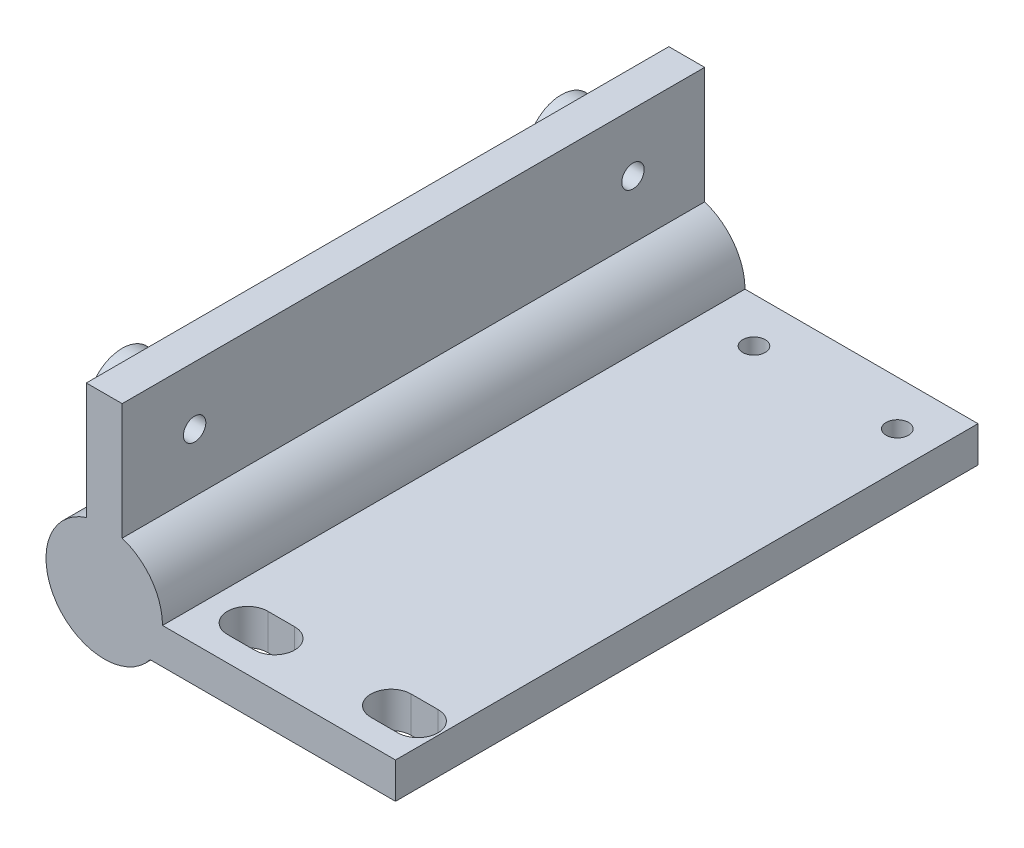
ISO-10303-21;
HEADER;
FILE_DESCRIPTION(('STEP AP214'),'2;1');
FILE_NAME('part.step','',(''),(''),'','','');
FILE_SCHEMA(('AUTOMOTIVE_DESIGN { 1 0 10303 214 1 1 1 1 }'));
ENDSEC;
DATA;
#1=APPLICATION_CONTEXT('core data for automotive mechanical design processes');
#2=APPLICATION_PROTOCOL_DEFINITION('international standard','automotive_design',2000,#1);
#3=PRODUCT_CONTEXT('',#1,'mechanical');
#4=PRODUCT('Part','Part','',(#3));
#5=PRODUCT_RELATED_PRODUCT_CATEGORY('part','',(#4));
#6=PRODUCT_DEFINITION_FORMATION('','',#4);
#7=PRODUCT_DEFINITION_CONTEXT('part definition',#1,'design');
#8=PRODUCT_DEFINITION('design','',#6,#7);
#9=PRODUCT_DEFINITION_SHAPE('','',#8);
#10=(LENGTH_UNIT() NAMED_UNIT(*) SI_UNIT(.MILLI.,.METRE.));
#11=(NAMED_UNIT(*) PLANE_ANGLE_UNIT() SI_UNIT($,.RADIAN.));
#12=(NAMED_UNIT(*) SI_UNIT($,.STERADIAN.) SOLID_ANGLE_UNIT());
#13=UNCERTAINTY_MEASURE_WITH_UNIT(LENGTH_MEASURE(1.E-05),#10,'distance_accuracy_value','');
#14=(GEOMETRIC_REPRESENTATION_CONTEXT(3) GLOBAL_UNCERTAINTY_ASSIGNED_CONTEXT((#13)) GLOBAL_UNIT_ASSIGNED_CONTEXT((#10,
#11,#12)) REPRESENTATION_CONTEXT('',''));
#15=CARTESIAN_POINT('',(0.,0.,0.));
#16=DIRECTION('',(0.,0.,1.));
#17=DIRECTION('',(1.,0.,0.));
#18=AXIS2_PLACEMENT_3D('',#15,#16,#17);
#19=CARTESIAN_POINT('',(0.,0.,65.));
#20=DIRECTION('',(0.,0.,-1.));
#21=DIRECTION('',(-1.,0.,0.));
#22=AXIS2_PLACEMENT_3D('',#19,#20,#21);
#23=CYLINDRICAL_SURFACE('',#22,4.1);
#24=CARTESIAN_POINT('',(0.,0.,0.));
#25=DIRECTION('',(0.,0.,1.));
#26=DIRECTION('',(1.,0.,0.));
#27=AXIS2_PLACEMENT_3D('',#24,#25,#26);
#28=CIRCLE('',#27,4.1);
#29=CARTESIAN_POINT('',(4.1,0.,0.));
#30=VERTEX_POINT('',#29);
#31=EDGE_CURVE('E239',#30,#30,#28,.T.);
#32=ORIENTED_EDGE('',*,*,#31,.F.);
#33=EDGE_LOOP('',(#32));
#34=FACE_BOUND('',#33,.T.);
#35=CARTESIAN_POINT('',(0.,0.,62.));
#36=DIRECTION('',(0.,0.,1.));
#37=DIRECTION('',(1.,0.,0.));
#38=AXIS2_PLACEMENT_3D('',#35,#36,#37);
#39=CIRCLE('',#38,4.1);
#40=CARTESIAN_POINT('',(4.1,0.,62.));
#41=VERTEX_POINT('',#40);
#42=EDGE_CURVE('E238',#41,#41,#39,.T.);
#43=ORIENTED_EDGE('',*,*,#42,.T.);
#44=EDGE_LOOP('',(#43));
#45=FACE_BOUND('',#44,.T.);
#46=ADVANCED_FACE('F43',(#34,#45),#23,.F.);
#47=CARTESIAN_POINT('',(0.,0.,65.));
#48=DIRECTION('',(0.,0.,1.));
#49=DIRECTION('',(1.,0.,0.));
#50=AXIS2_PLACEMENT_3D('',#47,#48,#49);
#51=PLANE('',#50);
#52=CARTESIAN_POINT('',(0.,0.,65.));
#53=DIRECTION('',(0.,0.,1.));
#54=DIRECTION('',(1.,0.,0.));
#55=AXIS2_PLACEMENT_3D('',#52,#53,#54);
#56=CIRCLE('',#55,6.5);
#57=CARTESIAN_POINT('',(-2.,6.18465843842649,65.));
#58=VERTEX_POINT('',#57);
#59=CARTESIAN_POINT('',(5.1234753829798,-4.,65.));
#60=VERTEX_POINT('',#59);
#61=EDGE_CURVE('E243',#58,#60,#56,.T.);
#62=ORIENTED_EDGE('',*,*,#61,.T.);
#63=DIRECTION('',(1.,0.,0.));
#64=VECTOR('',#63,1.);
#65=CARTESIAN_POINT('',(5.1234753829798,-4.,65.));
#66=LINE('',#65,#64);
#67=CARTESIAN_POINT('',(32.5,-4.,65.));
#68=VERTEX_POINT('',#67);
#69=EDGE_CURVE('E246',#60,#68,#66,.T.);
#70=ORIENTED_EDGE('',*,*,#69,.T.);
#71=DIRECTION('',(0.,1.,0.));
#72=VECTOR('',#71,1.);
#73=CARTESIAN_POINT('',(32.5,-4.,65.));
#74=LINE('',#73,#72);
#75=CARTESIAN_POINT('',(32.5,0.,65.));
#76=VERTEX_POINT('',#75);
#77=EDGE_CURVE('E249',#68,#76,#74,.T.);
#78=ORIENTED_EDGE('',*,*,#77,.T.);
#79=DIRECTION('',(-1.,0.,0.));
#80=VECTOR('',#79,1.);
#81=CARTESIAN_POINT('',(32.5,0.,65.));
#82=LINE('',#81,#80);
#83=CARTESIAN_POINT('',(6.5,0.,65.));
#84=VERTEX_POINT('',#83);
#85=EDGE_CURVE('E251',#76,#84,#82,.T.);
#86=ORIENTED_EDGE('',*,*,#85,.T.);
#87=CARTESIAN_POINT('',(0.,0.,65.));
#88=DIRECTION('',(0.,0.,1.));
#89=DIRECTION('',(1.,0.,0.));
#90=AXIS2_PLACEMENT_3D('',#87,#88,#89);
#91=CIRCLE('',#90,6.5);
#92=CARTESIAN_POINT('',(2.,6.18465843842649,65.));
#93=VERTEX_POINT('',#92);
#94=EDGE_CURVE('E253',#84,#93,#91,.T.);
#95=ORIENTED_EDGE('',*,*,#94,.T.);
#96=DIRECTION('',(0.,1.,0.));
#97=VECTOR('',#96,1.);
#98=CARTESIAN_POINT('',(2.,19.1846584384265,65.));
#99=LINE('',#98,#97);
#100=CARTESIAN_POINT('',(2.,19.1846584384265,65.));
#101=VERTEX_POINT('',#100);
#102=EDGE_CURVE('E255',#93,#101,#99,.T.);
#103=ORIENTED_EDGE('',*,*,#102,.T.);
#104=DIRECTION('',(-1.,0.,0.));
#105=VECTOR('',#104,1.);
#106=CARTESIAN_POINT('',(-2.,19.1846584384265,65.));
#107=LINE('',#106,#105);
#108=CARTESIAN_POINT('',(-2.,19.1846584384265,65.));
#109=VERTEX_POINT('',#108);
#110=EDGE_CURVE('E257',#101,#109,#107,.T.);
#111=ORIENTED_EDGE('',*,*,#110,.T.);
#112=DIRECTION('',(0.,-1.,0.));
#113=VECTOR('',#112,1.);
#114=CARTESIAN_POINT('',(-2.,19.1846584384265,65.));
#115=LINE('',#114,#113);
#116=EDGE_CURVE('E259',#109,#58,#115,.T.);
#117=ORIENTED_EDGE('',*,*,#116,.T.);
#118=EDGE_LOOP('',(#62,#70,#78,#86,#95,#103,#111,#117));
#119=FACE_BOUND('',#118,.T.);
#120=ADVANCED_FACE('F332',(#119),#51,.T.);
#121=CARTESIAN_POINT('',(0.,0.,0.));
#122=DIRECTION('',(0.,0.,1.));
#123=DIRECTION('',(1.,0.,0.));
#124=AXIS2_PLACEMENT_3D('',#121,#122,#123);
#125=PLANE('',#124);
#126=CARTESIAN_POINT('',(0.,0.,0.));
#127=DIRECTION('',(0.,0.,1.));
#128=DIRECTION('',(1.,0.,0.));
#129=AXIS2_PLACEMENT_3D('',#126,#127,#128);
#130=CIRCLE('',#129,6.5);
#131=CARTESIAN_POINT('',(-2.,6.18465843842649,0.));
#132=VERTEX_POINT('',#131);
#133=CARTESIAN_POINT('',(5.1234753829798,-4.,0.));
#134=VERTEX_POINT('',#133);
#135=EDGE_CURVE('E242',#132,#134,#130,.T.);
#136=ORIENTED_EDGE('',*,*,#135,.F.);
#137=DIRECTION('',(0.,-1.,0.));
#138=VECTOR('',#137,1.);
#139=CARTESIAN_POINT('',(-2.,19.1846584384265,0.));
#140=LINE('',#139,#138);
#141=CARTESIAN_POINT('',(-2.,19.1846584384265,0.));
#142=VERTEX_POINT('',#141);
#143=EDGE_CURVE('E247',#142,#132,#140,.T.);
#144=ORIENTED_EDGE('',*,*,#143,.F.);
#145=DIRECTION('',(-1.,0.,0.));
#146=VECTOR('',#145,1.);
#147=CARTESIAN_POINT('',(-2.,19.1846584384265,0.));
#148=LINE('',#147,#146);
#149=CARTESIAN_POINT('',(2.,19.1846584384265,0.));
#150=VERTEX_POINT('',#149);
#151=EDGE_CURVE('E274',#150,#142,#148,.T.);
#152=ORIENTED_EDGE('',*,*,#151,.F.);
#153=DIRECTION('',(0.,1.,0.));
#154=VECTOR('',#153,1.);
#155=CARTESIAN_POINT('',(2.,19.1846584384265,0.));
#156=LINE('',#155,#154);
#157=CARTESIAN_POINT('',(2.,6.18465843842649,0.));
#158=VERTEX_POINT('',#157);
#159=EDGE_CURVE('E272',#158,#150,#156,.T.);
#160=ORIENTED_EDGE('',*,*,#159,.F.);
#161=CARTESIAN_POINT('',(0.,0.,0.));
#162=DIRECTION('',(0.,0.,1.));
#163=DIRECTION('',(1.,0.,0.));
#164=AXIS2_PLACEMENT_3D('',#161,#162,#163);
#165=CIRCLE('',#164,6.5);
#166=CARTESIAN_POINT('',(6.5,0.,0.));
#167=VERTEX_POINT('',#166);
#168=EDGE_CURVE('E270',#167,#158,#165,.T.);
#169=ORIENTED_EDGE('',*,*,#168,.F.);
#170=DIRECTION('',(-1.,0.,0.));
#171=VECTOR('',#170,1.);
#172=CARTESIAN_POINT('',(32.5,0.,0.));
#173=LINE('',#172,#171);
#174=CARTESIAN_POINT('',(32.5,0.,0.));
#175=VERTEX_POINT('',#174);
#176=EDGE_CURVE('E268',#175,#167,#173,.T.);
#177=ORIENTED_EDGE('',*,*,#176,.F.);
#178=DIRECTION('',(0.,1.,0.));
#179=VECTOR('',#178,1.);
#180=CARTESIAN_POINT('',(32.5,-4.,0.));
#181=LINE('',#180,#179);
#182=CARTESIAN_POINT('',(32.5,-4.,0.));
#183=VERTEX_POINT('',#182);
#184=EDGE_CURVE('E266',#183,#175,#181,.T.);
#185=ORIENTED_EDGE('',*,*,#184,.F.);
#186=DIRECTION('',(1.,0.,0.));
#187=VECTOR('',#186,1.);
#188=CARTESIAN_POINT('',(5.1234753829798,-4.,0.));
#189=LINE('',#188,#187);
#190=EDGE_CURVE('E264',#134,#183,#189,.T.);
#191=ORIENTED_EDGE('',*,*,#190,.F.);
#192=EDGE_LOOP('',(#136,#144,#152,#160,#169,#177,#185,#191));
#193=FACE_BOUND('',#192,.T.);
#194=ORIENTED_EDGE('',*,*,#31,.T.);
#195=EDGE_LOOP('',(#194));
#196=FACE_BOUND('',#195,.T.);
#197=ADVANCED_FACE('F323',(#193,#196),#125,.F.);
#198=CARTESIAN_POINT('',(0.,0.,65.));
#199=DIRECTION('',(0.,0.,-1.));
#200=DIRECTION('',(-1.,0.,0.));
#201=AXIS2_PLACEMENT_3D('',#198,#199,#200);
#202=CYLINDRICAL_SURFACE('',#201,6.5);
#203=ORIENTED_EDGE('',*,*,#135,.T.);
#204=DIRECTION('',(0.,0.,-1.));
#205=VECTOR('',#204,1.);
#206=CARTESIAN_POINT('',(5.1234753829798,-4.,65.));
#207=LINE('',#206,#205);
#208=EDGE_CURVE('E297',#60,#134,#207,.T.);
#209=ORIENTED_EDGE('',*,*,#208,.F.);
#210=ORIENTED_EDGE('',*,*,#61,.F.);
#211=DIRECTION('',(0.,0.,-1.));
#212=VECTOR('',#211,1.);
#213=CARTESIAN_POINT('',(-2.,6.18465843842649,65.));
#214=LINE('',#213,#212);
#215=EDGE_CURVE('E261',#58,#132,#214,.T.);
#216=ORIENTED_EDGE('',*,*,#215,.T.);
#217=EDGE_LOOP('',(#203,#209,#210,#216));
#218=FACE_BOUND('',#217,.T.);
#219=ADVANCED_FACE('F45',(#218),#202,.T.);
#220=CARTESIAN_POINT('',(5.1234753829798,-4.,65.));
#221=DIRECTION('',(0.,1.,0.));
#222=DIRECTION('',(0.,0.,1.));
#223=AXIS2_PLACEMENT_3D('',#220,#221,#222);
#224=PLANE('',#223);
#225=DIRECTION('',(-1.,0.,0.));
#226=VECTOR('',#225,1.);
#227=CARTESIAN_POINT('',(5.12347538297978,-4.,57.75));
#228=LINE('',#227,#226);
#229=CARTESIAN_POINT('',(14.0000000000001,-4.,57.75));
#230=VERTEX_POINT('',#229);
#231=CARTESIAN_POINT('',(11.0000000000001,-4.,57.75));
#232=VERTEX_POINT('',#231);
#233=EDGE_CURVE('E232',#230,#232,#228,.T.);
#234=ORIENTED_EDGE('',*,*,#233,.T.);
#235=CARTESIAN_POINT('',(11.0000000000001,-4.,60.));
#236=DIRECTION('',(0.,1.,0.));
#237=DIRECTION('',(0.,0.,1.));
#238=AXIS2_PLACEMENT_3D('',#235,#236,#237);
#239=CIRCLE('',#238,2.25);
#240=CARTESIAN_POINT('',(11.0000000000001,-4.,62.25));
#241=VERTEX_POINT('',#240);
#242=EDGE_CURVE('E235',#232,#241,#239,.T.);
#243=ORIENTED_EDGE('',*,*,#242,.T.);
#244=DIRECTION('',(1.,0.,0.));
#245=VECTOR('',#244,1.);
#246=CARTESIAN_POINT('',(5.1234753829798,-4.,62.25));
#247=LINE('',#246,#245);
#248=CARTESIAN_POINT('',(14.,-4.,62.25));
#249=VERTEX_POINT('',#248);
#250=EDGE_CURVE('E226',#241,#249,#247,.T.);
#251=ORIENTED_EDGE('',*,*,#250,.T.);
#252=CARTESIAN_POINT('',(14.,-4.,60.));
#253=DIRECTION('',(0.,1.,0.));
#254=DIRECTION('',(0.,0.,1.));
#255=AXIS2_PLACEMENT_3D('',#252,#253,#254);
#256=CIRCLE('',#255,2.25000000000001);
#257=EDGE_CURVE('E229',#249,#230,#256,.T.);
#258=ORIENTED_EDGE('',*,*,#257,.T.);
#259=EDGE_LOOP('',(#234,#243,#251,#258));
#260=FACE_BOUND('',#259,.T.);
#261=DIRECTION('',(-1.,0.,0.));
#262=VECTOR('',#261,1.);
#263=CARTESIAN_POINT('',(5.1234753829798,-4.,57.75));
#264=LINE('',#263,#262);
#265=CARTESIAN_POINT('',(30.,-4.,57.75));
#266=VERTEX_POINT('',#265);
#267=CARTESIAN_POINT('',(27.,-4.,57.75));
#268=VERTEX_POINT('',#267);
#269=EDGE_CURVE('E223',#266,#268,#264,.T.);
#270=ORIENTED_EDGE('',*,*,#269,.T.);
#271=CARTESIAN_POINT('',(27.,-4.,60.));
#272=DIRECTION('',(0.,1.,0.));
#273=DIRECTION('',(0.,0.,1.));
#274=AXIS2_PLACEMENT_3D('',#271,#272,#273);
#275=CIRCLE('',#274,2.25);
#276=CARTESIAN_POINT('',(27.,-4.,62.25));
#277=VERTEX_POINT('',#276);
#278=EDGE_CURVE('E163',#268,#277,#275,.T.);
#279=ORIENTED_EDGE('',*,*,#278,.T.);
#280=DIRECTION('',(1.,0.,0.));
#281=VECTOR('',#280,1.);
#282=CARTESIAN_POINT('',(5.1234753829798,-4.,62.25));
#283=LINE('',#282,#281);
#284=CARTESIAN_POINT('',(30.,-4.,62.25));
#285=VERTEX_POINT('',#284);
#286=EDGE_CURVE('E217',#277,#285,#283,.T.);
#287=ORIENTED_EDGE('',*,*,#286,.T.);
#288=CARTESIAN_POINT('',(30.,-4.,60.));
#289=DIRECTION('',(0.,1.,0.));
#290=DIRECTION('',(0.,0.,1.));
#291=AXIS2_PLACEMENT_3D('',#288,#289,#290);
#292=CIRCLE('',#291,2.25);
#293=EDGE_CURVE('E220',#285,#266,#292,.T.);
#294=ORIENTED_EDGE('',*,*,#293,.T.);
#295=EDGE_LOOP('',(#270,#279,#287,#294));
#296=FACE_BOUND('',#295,.T.);
#297=CARTESIAN_POINT('',(28.5,-4.,5.));
#298=DIRECTION('',(0.,1.,0.));
#299=DIRECTION('',(0.,0.,1.));
#300=AXIS2_PLACEMENT_3D('',#297,#298,#299);
#301=CIRCLE('',#300,1.25);
#302=CARTESIAN_POINT('',(28.5,-4.,6.25000000000001));
#303=VERTEX_POINT('',#302);
#304=EDGE_CURVE('E214',#303,#303,#301,.T.);
#305=ORIENTED_EDGE('',*,*,#304,.T.);
#306=EDGE_LOOP('',(#305));
#307=FACE_BOUND('',#306,.T.);
#308=CARTESIAN_POINT('',(12.5,-4.,5.));
#309=DIRECTION('',(0.,1.,0.));
#310=DIRECTION('',(0.,0.,1.));
#311=AXIS2_PLACEMENT_3D('',#308,#309,#310);
#312=CIRCLE('',#311,1.25);
#313=CARTESIAN_POINT('',(12.5,-4.,6.25));
#314=VERTEX_POINT('',#313);
#315=EDGE_CURVE('E211',#314,#314,#312,.T.);
#316=ORIENTED_EDGE('',*,*,#315,.T.);
#317=EDGE_LOOP('',(#316));
#318=FACE_BOUND('',#317,.T.);
#319=ORIENTED_EDGE('',*,*,#190,.T.);
#320=DIRECTION('',(0.,0.,-1.));
#321=VECTOR('',#320,1.);
#322=CARTESIAN_POINT('',(32.5,-4.,65.));
#323=LINE('',#322,#321);
#324=EDGE_CURVE('E294',#68,#183,#323,.T.);
#325=ORIENTED_EDGE('',*,*,#324,.F.);
#326=ORIENTED_EDGE('',*,*,#69,.F.);
#327=ORIENTED_EDGE('',*,*,#208,.T.);
#328=EDGE_LOOP('',(#319,#325,#326,#327));
#329=FACE_BOUND('',#328,.T.);
#330=ADVANCED_FACE('F329',(#260,#296,#307,#318,#329),#224,.F.);
#331=CARTESIAN_POINT('',(32.5,-4.,65.));
#332=DIRECTION('',(-1.,0.,0.));
#333=DIRECTION('',(0.,0.,1.));
#334=AXIS2_PLACEMENT_3D('',#331,#332,#333);
#335=PLANE('',#334);
#336=ORIENTED_EDGE('',*,*,#184,.T.);
#337=DIRECTION('',(0.,0.,-1.));
#338=VECTOR('',#337,1.);
#339=CARTESIAN_POINT('',(32.5,0.,65.));
#340=LINE('',#339,#338);
#341=EDGE_CURVE('E291',#76,#175,#340,.T.);
#342=ORIENTED_EDGE('',*,*,#341,.F.);
#343=ORIENTED_EDGE('',*,*,#77,.F.);
#344=ORIENTED_EDGE('',*,*,#324,.T.);
#345=EDGE_LOOP('',(#336,#342,#343,#344));
#346=FACE_BOUND('',#345,.T.);
#347=ADVANCED_FACE('F350',(#346),#335,.F.);
#348=CARTESIAN_POINT('',(32.5,0.,65.));
#349=DIRECTION('',(0.,-1.,0.));
#350=DIRECTION('',(1.,0.,0.));
#351=AXIS2_PLACEMENT_3D('',#348,#349,#350);
#352=PLANE('',#351);
#353=DIRECTION('',(1.,0.,0.));
#354=VECTOR('',#353,1.);
#355=CARTESIAN_POINT('',(11.0000000000001,0.,62.25));
#356=LINE('',#355,#354);
#357=CARTESIAN_POINT('',(11.0000000000001,0.,62.25));
#358=VERTEX_POINT('',#357);
#359=CARTESIAN_POINT('',(14.,0.,62.25));
#360=VERTEX_POINT('',#359);
#361=EDGE_CURVE('E206',#358,#360,#356,.T.);
#362=ORIENTED_EDGE('',*,*,#361,.F.);
#363=CARTESIAN_POINT('',(11.0000000000001,0.,60.));
#364=DIRECTION('',(0.,1.,0.));
#365=DIRECTION('',(-1.,0.,0.));
#366=AXIS2_PLACEMENT_3D('',#363,#364,#365);
#367=CIRCLE('',#366,2.25);
#368=CARTESIAN_POINT('',(11.0000000000001,0.,57.75));
#369=VERTEX_POINT('',#368);
#370=EDGE_CURVE('E167',#369,#358,#367,.T.);
#371=ORIENTED_EDGE('',*,*,#370,.F.);
#372=DIRECTION('',(-1.,0.,0.));
#373=VECTOR('',#372,1.);
#374=CARTESIAN_POINT('',(11.0000000000001,0.,57.75));
#375=LINE('',#374,#373);
#376=CARTESIAN_POINT('',(14.0000000000001,0.,57.75));
#377=VERTEX_POINT('',#376);
#378=EDGE_CURVE('E194',#377,#369,#375,.T.);
#379=ORIENTED_EDGE('',*,*,#378,.F.);
#380=CARTESIAN_POINT('',(14.,0.,60.));
#381=DIRECTION('',(0.,1.,0.));
#382=DIRECTION('',(-1.,0.,0.));
#383=AXIS2_PLACEMENT_3D('',#380,#381,#382);
#384=CIRCLE('',#383,2.25000000000001);
#385=EDGE_CURVE('E203',#360,#377,#384,.T.);
#386=ORIENTED_EDGE('',*,*,#385,.F.);
#387=EDGE_LOOP('',(#362,#371,#379,#386));
#388=FACE_BOUND('',#387,.T.);
#389=DIRECTION('',(1.,0.,0.));
#390=VECTOR('',#389,1.);
#391=CARTESIAN_POINT('',(27.,0.,62.25));
#392=LINE('',#391,#390);
#393=CARTESIAN_POINT('',(27.,0.,62.25));
#394=VERTEX_POINT('',#393);
#395=CARTESIAN_POINT('',(30.,0.,62.25));
#396=VERTEX_POINT('',#395);
#397=EDGE_CURVE('E182',#394,#396,#392,.T.);
#398=ORIENTED_EDGE('',*,*,#397,.F.);
#399=CARTESIAN_POINT('',(27.,0.,60.));
#400=DIRECTION('',(0.,1.,0.));
#401=DIRECTION('',(-1.,0.,0.));
#402=AXIS2_PLACEMENT_3D('',#399,#400,#401);
#403=CIRCLE('',#402,2.25);
#404=CARTESIAN_POINT('',(27.,0.,57.75));
#405=VERTEX_POINT('',#404);
#406=EDGE_CURVE('E160',#405,#394,#403,.T.);
#407=ORIENTED_EDGE('',*,*,#406,.F.);
#408=DIRECTION('',(-1.,0.,0.));
#409=VECTOR('',#408,1.);
#410=CARTESIAN_POINT('',(27.,0.,57.75));
#411=LINE('',#410,#409);
#412=CARTESIAN_POINT('',(30.,0.,57.75));
#413=VERTEX_POINT('',#412);
#414=EDGE_CURVE('E170',#413,#405,#411,.T.);
#415=ORIENTED_EDGE('',*,*,#414,.F.);
#416=CARTESIAN_POINT('',(30.,0.,60.));
#417=DIRECTION('',(0.,1.,0.));
#418=DIRECTION('',(-1.,0.,0.));
#419=AXIS2_PLACEMENT_3D('',#416,#417,#418);
#420=CIRCLE('',#419,2.25);
#421=EDGE_CURVE('E176',#396,#413,#420,.T.);
#422=ORIENTED_EDGE('',*,*,#421,.F.);
#423=EDGE_LOOP('',(#398,#407,#415,#422));
#424=FACE_BOUND('',#423,.T.);
#425=CARTESIAN_POINT('',(28.5,0.,5.));
#426=DIRECTION('',(0.,1.,0.));
#427=DIRECTION('',(-1.,0.,0.));
#428=AXIS2_PLACEMENT_3D('',#425,#426,#427);
#429=CIRCLE('',#428,1.25);
#430=CARTESIAN_POINT('',(27.25,0.,5.));
#431=VERTEX_POINT('',#430);
#432=EDGE_CURVE('E183',#431,#431,#429,.T.);
#433=ORIENTED_EDGE('',*,*,#432,.F.);
#434=EDGE_LOOP('',(#433));
#435=FACE_BOUND('',#434,.T.);
#436=CARTESIAN_POINT('',(12.5,0.,5.));
#437=DIRECTION('',(0.,1.,0.));
#438=DIRECTION('',(-1.,0.,0.));
#439=AXIS2_PLACEMENT_3D('',#436,#437,#438);
#440=CIRCLE('',#439,1.25);
#441=CARTESIAN_POINT('',(11.25,0.,5.));
#442=VERTEX_POINT('',#441);
#443=EDGE_CURVE('E186',#442,#442,#440,.T.);
#444=ORIENTED_EDGE('',*,*,#443,.F.);
#445=EDGE_LOOP('',(#444));
#446=FACE_BOUND('',#445,.T.);
#447=ORIENTED_EDGE('',*,*,#176,.T.);
#448=DIRECTION('',(0.,0.,-1.));
#449=VECTOR('',#448,1.);
#450=CARTESIAN_POINT('',(6.5,0.,65.));
#451=LINE('',#450,#449);
#452=EDGE_CURVE('E288',#84,#167,#451,.T.);
#453=ORIENTED_EDGE('',*,*,#452,.F.);
#454=ORIENTED_EDGE('',*,*,#85,.F.);
#455=ORIENTED_EDGE('',*,*,#341,.T.);
#456=EDGE_LOOP('',(#447,#453,#454,#455));
#457=FACE_BOUND('',#456,.T.);
#458=ADVANCED_FACE('F180',(#388,#424,#435,#446,#457),#352,.F.);
#459=CARTESIAN_POINT('',(0.,0.,65.));
#460=DIRECTION('',(0.,0.,-1.));
#461=DIRECTION('',(-1.,0.,0.));
#462=AXIS2_PLACEMENT_3D('',#459,#460,#461);
#463=CYLINDRICAL_SURFACE('',#462,6.5);
#464=ORIENTED_EDGE('',*,*,#168,.T.);
#465=DIRECTION('',(0.,0.,-1.));
#466=VECTOR('',#465,1.);
#467=CARTESIAN_POINT('',(2.,6.18465843842649,65.));
#468=LINE('',#467,#466);
#469=EDGE_CURVE('E285',#93,#158,#468,.T.);
#470=ORIENTED_EDGE('',*,*,#469,.F.);
#471=ORIENTED_EDGE('',*,*,#94,.F.);
#472=ORIENTED_EDGE('',*,*,#452,.T.);
#473=EDGE_LOOP('',(#464,#470,#471,#472));
#474=FACE_BOUND('',#473,.T.);
#475=ADVANCED_FACE('F344',(#474),#463,.T.);
#476=CARTESIAN_POINT('',(2.,19.1846584384265,65.));
#477=DIRECTION('',(-1.,0.,0.));
#478=DIRECTION('',(0.,-1.,0.));
#479=AXIS2_PLACEMENT_3D('',#476,#477,#478);
#480=PLANE('',#479);
#481=CARTESIAN_POINT('',(2.,12.6846584384265,8.));
#482=DIRECTION('',(-1.,0.,0.));
#483=DIRECTION('',(0.,-1.,0.));
#484=AXIS2_PLACEMENT_3D('',#481,#482,#483);
#485=CIRCLE('',#484,1.25);
#486=CARTESIAN_POINT('',(2.,11.4346584384265,8.));
#487=VERTEX_POINT('',#486);
#488=EDGE_CURVE('E582',#487,#487,#485,.T.);
#489=ORIENTED_EDGE('',*,*,#488,.T.);
#490=EDGE_LOOP('',(#489));
#491=FACE_BOUND('',#490,.T.);
#492=CARTESIAN_POINT('',(2.,12.6846584384265,56.916589889199));
#493=DIRECTION('',(-1.,0.,0.));
#494=DIRECTION('',(0.,-1.,0.));
#495=AXIS2_PLACEMENT_3D('',#492,#493,#494);
#496=CIRCLE('',#495,1.25);
#497=CARTESIAN_POINT('',(2.,11.4346584384265,56.916589889199));
#498=VERTEX_POINT('',#497);
#499=EDGE_CURVE('E584',#498,#498,#496,.T.);
#500=ORIENTED_EDGE('',*,*,#499,.T.);
#501=EDGE_LOOP('',(#500));
#502=FACE_BOUND('',#501,.T.);
#503=ORIENTED_EDGE('',*,*,#159,.T.);
#504=DIRECTION('',(0.,0.,-1.));
#505=VECTOR('',#504,1.);
#506=CARTESIAN_POINT('',(2.,19.1846584384265,65.));
#507=LINE('',#506,#505);
#508=EDGE_CURVE('E282',#101,#150,#507,.T.);
#509=ORIENTED_EDGE('',*,*,#508,.F.);
#510=ORIENTED_EDGE('',*,*,#102,.F.);
#511=ORIENTED_EDGE('',*,*,#469,.T.);
#512=EDGE_LOOP('',(#503,#509,#510,#511));
#513=FACE_BOUND('',#512,.T.);
#514=ADVANCED_FACE('F340',(#491,#502,#513),#480,.F.);
#515=CARTESIAN_POINT('',(-2.,19.1846584384265,65.));
#516=DIRECTION('',(0.,-1.,0.));
#517=DIRECTION('',(0.,0.,-1.));
#518=AXIS2_PLACEMENT_3D('',#515,#516,#517);
#519=PLANE('',#518);
#520=ORIENTED_EDGE('',*,*,#151,.T.);
#521=DIRECTION('',(0.,0.,-1.));
#522=VECTOR('',#521,1.);
#523=CARTESIAN_POINT('',(-2.,19.1846584384265,65.));
#524=LINE('',#523,#522);
#525=EDGE_CURVE('E279',#109,#142,#524,.T.);
#526=ORIENTED_EDGE('',*,*,#525,.F.);
#527=ORIENTED_EDGE('',*,*,#110,.F.);
#528=ORIENTED_EDGE('',*,*,#508,.T.);
#529=EDGE_LOOP('',(#520,#526,#527,#528));
#530=FACE_BOUND('',#529,.T.);
#531=ADVANCED_FACE('F310',(#530),#519,.F.);
#532=CARTESIAN_POINT('',(-2.,19.1846584384265,65.));
#533=DIRECTION('',(1.,0.,0.));
#534=DIRECTION('',(0.,1.,0.));
#535=AXIS2_PLACEMENT_3D('',#532,#533,#534);
#536=PLANE('',#535);
#537=CARTESIAN_POINT('',(-2.,12.6846584384265,57.));
#538=DIRECTION('',(1.,0.,0.));
#539=DIRECTION('',(0.,1.,0.));
#540=AXIS2_PLACEMENT_3D('',#537,#538,#539);
#541=CIRCLE('',#540,3.85);
#542=CARTESIAN_POINT('',(-2.,16.5346584384265,57.));
#543=VERTEX_POINT('',#542);
#544=EDGE_CURVE('E11',#543,#543,#541,.F.);
#545=ORIENTED_EDGE('',*,*,#544,.F.);
#546=EDGE_LOOP('',(#545));
#547=FACE_BOUND('',#546,.T.);
#548=CARTESIAN_POINT('',(-2.,12.6846584384265,8.));
#549=DIRECTION('',(1.,0.,0.));
#550=DIRECTION('',(0.,1.,0.));
#551=AXIS2_PLACEMENT_3D('',#548,#549,#550);
#552=CIRCLE('',#551,3.85);
#553=CARTESIAN_POINT('',(-2.,16.5346584384265,8.));
#554=VERTEX_POINT('',#553);
#555=EDGE_CURVE('E51',#554,#554,#552,.F.);
#556=ORIENTED_EDGE('',*,*,#555,.F.);
#557=EDGE_LOOP('',(#556));
#558=FACE_BOUND('',#557,.T.);
#559=ORIENTED_EDGE('',*,*,#143,.T.);
#560=ORIENTED_EDGE('',*,*,#215,.F.);
#561=ORIENTED_EDGE('',*,*,#116,.F.);
#562=ORIENTED_EDGE('',*,*,#525,.T.);
#563=EDGE_LOOP('',(#559,#560,#561,#562));
#564=FACE_BOUND('',#563,.T.);
#565=ADVANCED_FACE('F306',(#547,#558,#564),#536,.F.);
#566=CARTESIAN_POINT('',(0.,0.,62.));
#567=DIRECTION('',(0.,0.,1.));
#568=DIRECTION('',(1.,0.,0.));
#569=AXIS2_PLACEMENT_3D('',#566,#567,#568);
#570=PLANE('',#569);
#571=ORIENTED_EDGE('',*,*,#42,.F.);
#572=EDGE_LOOP('',(#571));
#573=FACE_BOUND('',#572,.T.);
#574=ADVANCED_FACE('F309',(#573),#570,.F.);
#575=CARTESIAN_POINT('',(12.5,-13.,5.));
#576=DIRECTION('',(0.,1.,0.));
#577=DIRECTION('',(-1.,0.,0.));
#578=AXIS2_PLACEMENT_3D('',#575,#576,#577);
#579=CYLINDRICAL_SURFACE('',#578,1.25);
#580=ORIENTED_EDGE('',*,*,#443,.T.);
#581=EDGE_LOOP('',(#580));
#582=FACE_BOUND('',#581,.T.);
#583=ORIENTED_EDGE('',*,*,#315,.F.);
#584=EDGE_LOOP('',(#583));
#585=FACE_BOUND('',#584,.T.);
#586=ADVANCED_FACE('F424',(#582,#585),#579,.F.);
#587=CARTESIAN_POINT('',(28.5,-13.,5.));
#588=DIRECTION('',(0.,1.,0.));
#589=DIRECTION('',(-1.,0.,0.));
#590=AXIS2_PLACEMENT_3D('',#587,#588,#589);
#591=CYLINDRICAL_SURFACE('',#590,1.25);
#592=ORIENTED_EDGE('',*,*,#432,.T.);
#593=EDGE_LOOP('',(#592));
#594=FACE_BOUND('',#593,.T.);
#595=ORIENTED_EDGE('',*,*,#304,.F.);
#596=EDGE_LOOP('',(#595));
#597=FACE_BOUND('',#596,.T.);
#598=ADVANCED_FACE('F433',(#594,#597),#591,.F.);
#599=CARTESIAN_POINT('',(27.,-13.,60.));
#600=DIRECTION('',(0.,1.,0.));
#601=DIRECTION('',(-1.,0.,0.));
#602=AXIS2_PLACEMENT_3D('',#599,#600,#601);
#603=CYLINDRICAL_SURFACE('',#602,2.25);
#604=DIRECTION('',(0.,1.,0.));
#605=VECTOR('',#604,1.);
#606=CARTESIAN_POINT('',(27.,-13.,57.75));
#607=LINE('',#606,#605);
#608=EDGE_CURVE('E155',#268,#405,#607,.T.);
#609=ORIENTED_EDGE('',*,*,#608,.T.);
#610=ORIENTED_EDGE('',*,*,#406,.T.);
#611=DIRECTION('',(0.,1.,0.));
#612=VECTOR('',#611,1.);
#613=CARTESIAN_POINT('',(27.,-13.,62.25));
#614=LINE('',#613,#612);
#615=EDGE_CURVE('E177',#277,#394,#614,.T.);
#616=ORIENTED_EDGE('',*,*,#615,.F.);
#617=ORIENTED_EDGE('',*,*,#278,.F.);
#618=EDGE_LOOP('',(#609,#610,#616,#617));
#619=FACE_BOUND('',#618,.T.);
#620=ADVANCED_FACE('F157',(#619),#603,.F.);
#621=CARTESIAN_POINT('',(27.,-13.,57.75));
#622=DIRECTION('',(0.,0.,-1.));
#623=DIRECTION('',(-1.,0.,0.));
#624=AXIS2_PLACEMENT_3D('',#621,#622,#623);
#625=PLANE('',#624);
#626=DIRECTION('',(0.,1.,0.));
#627=VECTOR('',#626,1.);
#628=CARTESIAN_POINT('',(30.,-13.,57.75));
#629=LINE('',#628,#627);
#630=EDGE_CURVE('E166',#266,#413,#629,.T.);
#631=ORIENTED_EDGE('',*,*,#630,.T.);
#632=ORIENTED_EDGE('',*,*,#414,.T.);
#633=ORIENTED_EDGE('',*,*,#608,.F.);
#634=ORIENTED_EDGE('',*,*,#269,.F.);
#635=EDGE_LOOP('',(#631,#632,#633,#634));
#636=FACE_BOUND('',#635,.T.);
#637=ADVANCED_FACE('F171',(#636),#625,.F.);
#638=CARTESIAN_POINT('',(30.,-13.,60.));
#639=DIRECTION('',(0.,1.,0.));
#640=DIRECTION('',(-1.,0.,0.));
#641=AXIS2_PLACEMENT_3D('',#638,#639,#640);
#642=CYLINDRICAL_SURFACE('',#641,2.25);
#643=DIRECTION('',(0.,1.,0.));
#644=VECTOR('',#643,1.);
#645=CARTESIAN_POINT('',(30.,-13.,62.25));
#646=LINE('',#645,#644);
#647=EDGE_CURVE('E66',#285,#396,#646,.T.);
#648=ORIENTED_EDGE('',*,*,#647,.T.);
#649=ORIENTED_EDGE('',*,*,#421,.T.);
#650=ORIENTED_EDGE('',*,*,#630,.F.);
#651=ORIENTED_EDGE('',*,*,#293,.F.);
#652=EDGE_LOOP('',(#648,#649,#650,#651));
#653=FACE_BOUND('',#652,.T.);
#654=ADVANCED_FACE('F459',(#653),#642,.F.);
#655=CARTESIAN_POINT('',(27.,-13.,62.25));
#656=DIRECTION('',(0.,0.,1.));
#657=DIRECTION('',(1.,0.,0.));
#658=AXIS2_PLACEMENT_3D('',#655,#656,#657);
#659=PLANE('',#658);
#660=ORIENTED_EDGE('',*,*,#615,.T.);
#661=ORIENTED_EDGE('',*,*,#397,.T.);
#662=ORIENTED_EDGE('',*,*,#647,.F.);
#663=ORIENTED_EDGE('',*,*,#286,.F.);
#664=EDGE_LOOP('',(#660,#661,#662,#663));
#665=FACE_BOUND('',#664,.T.);
#666=ADVANCED_FACE('F468',(#665),#659,.F.);
#667=CARTESIAN_POINT('',(11.0000000000001,-13.,60.));
#668=DIRECTION('',(0.,1.,0.));
#669=DIRECTION('',(-1.,0.,0.));
#670=AXIS2_PLACEMENT_3D('',#667,#668,#669);
#671=CYLINDRICAL_SURFACE('',#670,2.25);
#672=DIRECTION('',(0.,1.,0.));
#673=VECTOR('',#672,1.);
#674=CARTESIAN_POINT('',(11.0000000000001,-13.,57.75));
#675=LINE('',#674,#673);
#676=EDGE_CURVE('E198',#232,#369,#675,.T.);
#677=ORIENTED_EDGE('',*,*,#676,.T.);
#678=ORIENTED_EDGE('',*,*,#370,.T.);
#679=DIRECTION('',(0.,1.,0.));
#680=VECTOR('',#679,1.);
#681=CARTESIAN_POINT('',(11.0000000000001,-13.,62.25));
#682=LINE('',#681,#680);
#683=EDGE_CURVE('E191',#241,#358,#682,.T.);
#684=ORIENTED_EDGE('',*,*,#683,.F.);
#685=ORIENTED_EDGE('',*,*,#242,.F.);
#686=EDGE_LOOP('',(#677,#678,#684,#685));
#687=FACE_BOUND('',#686,.T.);
#688=ADVANCED_FACE('F478',(#687),#671,.F.);
#689=CARTESIAN_POINT('',(11.0000000000001,-13.,57.75));
#690=DIRECTION('',(0.,0.,-1.));
#691=DIRECTION('',(-1.,0.,0.));
#692=AXIS2_PLACEMENT_3D('',#689,#690,#691);
#693=PLANE('',#692);
#694=DIRECTION('',(0.,1.,0.));
#695=VECTOR('',#694,1.);
#696=CARTESIAN_POINT('',(14.0000000000001,-13.,57.75));
#697=LINE('',#696,#695);
#698=EDGE_CURVE('E196',#230,#377,#697,.T.);
#699=ORIENTED_EDGE('',*,*,#698,.T.);
#700=ORIENTED_EDGE('',*,*,#378,.T.);
#701=ORIENTED_EDGE('',*,*,#676,.F.);
#702=ORIENTED_EDGE('',*,*,#233,.F.);
#703=EDGE_LOOP('',(#699,#700,#701,#702));
#704=FACE_BOUND('',#703,.T.);
#705=ADVANCED_FACE('F487',(#704),#693,.F.);
#706=CARTESIAN_POINT('',(14.,-13.,60.));
#707=DIRECTION('',(0.,1.,0.));
#708=DIRECTION('',(-1.,0.,0.));
#709=AXIS2_PLACEMENT_3D('',#706,#707,#708);
#710=CYLINDRICAL_SURFACE('',#709,2.25000000000001);
#711=DIRECTION('',(0.,1.,0.));
#712=VECTOR('',#711,1.);
#713=CARTESIAN_POINT('',(14.,-13.,62.25));
#714=LINE('',#713,#712);
#715=EDGE_CURVE('E58',#249,#360,#714,.T.);
#716=ORIENTED_EDGE('',*,*,#715,.T.);
#717=ORIENTED_EDGE('',*,*,#385,.T.);
#718=ORIENTED_EDGE('',*,*,#698,.F.);
#719=ORIENTED_EDGE('',*,*,#257,.F.);
#720=EDGE_LOOP('',(#716,#717,#718,#719));
#721=FACE_BOUND('',#720,.T.);
#722=ADVANCED_FACE('F497',(#721),#710,.F.);
#723=CARTESIAN_POINT('',(11.0000000000001,-13.,62.25));
#724=DIRECTION('',(0.,0.,1.));
#725=DIRECTION('',(1.,0.,0.));
#726=AXIS2_PLACEMENT_3D('',#723,#724,#725);
#727=PLANE('',#726);
#728=ORIENTED_EDGE('',*,*,#683,.T.);
#729=ORIENTED_EDGE('',*,*,#361,.T.);
#730=ORIENTED_EDGE('',*,*,#715,.F.);
#731=ORIENTED_EDGE('',*,*,#250,.F.);
#732=EDGE_LOOP('',(#728,#729,#730,#731));
#733=FACE_BOUND('',#732,.T.);
#734=ADVANCED_FACE('F507',(#733),#727,.F.);
#735=CARTESIAN_POINT('',(-6.,12.6846584384265,8.));
#736=DIRECTION('',(1.,0.,0.));
#737=DIRECTION('',(0.,1.,0.));
#738=AXIS2_PLACEMENT_3D('',#735,#736,#737);
#739=CYLINDRICAL_SURFACE('',#738,3.85);
#740=CARTESIAN_POINT('',(-6.,12.6846584384265,8.));
#741=DIRECTION('',(-1.,0.,0.));
#742=DIRECTION('',(0.,-1.,0.));
#743=AXIS2_PLACEMENT_3D('',#740,#741,#742);
#744=CIRCLE('',#743,3.85);
#745=CARTESIAN_POINT('',(-6.,8.83465843842649,8.));
#746=VERTEX_POINT('',#745);
#747=EDGE_CURVE('E200',#746,#746,#744,.T.);
#748=ORIENTED_EDGE('',*,*,#747,.F.);
#749=EDGE_LOOP('',(#748));
#750=FACE_BOUND('',#749,.T.);
#751=ORIENTED_EDGE('',*,*,#555,.T.);
#752=EDGE_LOOP('',(#751));
#753=FACE_BOUND('',#752,.T.);
#754=ADVANCED_FACE('F304',(#750,#753),#739,.T.);
#755=CARTESIAN_POINT('',(-6.,12.6846584384265,8.));
#756=DIRECTION('',(-1.,0.,0.));
#757=DIRECTION('',(0.,-1.,0.));
#758=AXIS2_PLACEMENT_3D('',#755,#756,#757);
#759=PLANE('',#758);
#760=CARTESIAN_POINT('',(-6.,12.6846584384265,8.));
#761=DIRECTION('',(-1.,0.,0.));
#762=DIRECTION('',(0.,-1.,0.));
#763=AXIS2_PLACEMENT_3D('',#760,#761,#762);
#764=CIRCLE('',#763,1.25);
#765=CARTESIAN_POINT('',(-6.,11.4346584384265,8.));
#766=VERTEX_POINT('',#765);
#767=EDGE_CURVE('E579',#766,#766,#764,.T.);
#768=ORIENTED_EDGE('',*,*,#767,.F.);
#769=EDGE_LOOP('',(#768));
#770=FACE_BOUND('',#769,.T.);
#771=ORIENTED_EDGE('',*,*,#747,.T.);
#772=EDGE_LOOP('',(#771));
#773=FACE_BOUND('',#772,.T.);
#774=ADVANCED_FACE('F523',(#770,#773),#759,.T.);
#775=CARTESIAN_POINT('',(-6.,12.6846584384265,57.));
#776=DIRECTION('',(1.,0.,0.));
#777=DIRECTION('',(0.,1.,0.));
#778=AXIS2_PLACEMENT_3D('',#775,#776,#777);
#779=CYLINDRICAL_SURFACE('',#778,3.85);
#780=CARTESIAN_POINT('',(-6.,12.6846584384265,57.));
#781=DIRECTION('',(-1.,0.,0.));
#782=DIRECTION('',(0.,-1.,0.));
#783=AXIS2_PLACEMENT_3D('',#780,#781,#782);
#784=CIRCLE('',#783,3.85);
#785=CARTESIAN_POINT('',(-6.,8.83465843842649,57.));
#786=VERTEX_POINT('',#785);
#787=EDGE_CURVE('E583',#786,#786,#784,.T.);
#788=ORIENTED_EDGE('',*,*,#787,.F.);
#789=EDGE_LOOP('',(#788));
#790=FACE_BOUND('',#789,.T.);
#791=ORIENTED_EDGE('',*,*,#544,.T.);
#792=EDGE_LOOP('',(#791));
#793=FACE_BOUND('',#792,.T.);
#794=ADVANCED_FACE('F534',(#790,#793),#779,.T.);
#795=CARTESIAN_POINT('',(-6.,12.6846584384265,57.));
#796=DIRECTION('',(-1.,0.,0.));
#797=DIRECTION('',(0.,-1.,0.));
#798=AXIS2_PLACEMENT_3D('',#795,#796,#797);
#799=PLANE('',#798);
#800=CARTESIAN_POINT('',(-6.,12.6846584384265,56.916589889199));
#801=DIRECTION('',(-1.,0.,0.));
#802=DIRECTION('',(0.,-1.,0.));
#803=AXIS2_PLACEMENT_3D('',#800,#801,#802);
#804=CIRCLE('',#803,1.25);
#805=CARTESIAN_POINT('',(-6.,11.4346584384265,56.916589889199));
#806=VERTEX_POINT('',#805);
#807=EDGE_CURVE('E605',#806,#806,#804,.T.);
#808=ORIENTED_EDGE('',*,*,#807,.F.);
#809=EDGE_LOOP('',(#808));
#810=FACE_BOUND('',#809,.T.);
#811=ORIENTED_EDGE('',*,*,#787,.T.);
#812=EDGE_LOOP('',(#811));
#813=FACE_BOUND('',#812,.T.);
#814=ADVANCED_FACE('F544',(#810,#813),#799,.T.);
#815=CARTESIAN_POINT('',(8.,12.6846584384265,56.916589889199));
#816=DIRECTION('',(-1.,0.,0.));
#817=DIRECTION('',(0.,-1.,0.));
#818=AXIS2_PLACEMENT_3D('',#815,#816,#817);
#819=CYLINDRICAL_SURFACE('',#818,1.25);
#820=ORIENTED_EDGE('',*,*,#807,.T.);
#821=EDGE_LOOP('',(#820));
#822=FACE_BOUND('',#821,.T.);
#823=ORIENTED_EDGE('',*,*,#499,.F.);
#824=EDGE_LOOP('',(#823));
#825=FACE_BOUND('',#824,.T.);
#826=ADVANCED_FACE('F553',(#822,#825),#819,.F.);
#827=CARTESIAN_POINT('',(8.,12.6846584384265,8.));
#828=DIRECTION('',(-1.,0.,0.));
#829=DIRECTION('',(0.,-1.,0.));
#830=AXIS2_PLACEMENT_3D('',#827,#828,#829);
#831=CYLINDRICAL_SURFACE('',#830,1.25);
#832=ORIENTED_EDGE('',*,*,#767,.T.);
#833=EDGE_LOOP('',(#832));
#834=FACE_BOUND('',#833,.T.);
#835=ORIENTED_EDGE('',*,*,#488,.F.);
#836=EDGE_LOOP('',(#835));
#837=FACE_BOUND('',#836,.T.);
#838=ADVANCED_FACE('F563',(#834,#837),#831,.F.);
#839=CLOSED_SHELL('',(#46,#120,#197,#219,#330,#347,#458,#475,#514,#531,#565,#574,#586,#598,#620,
#637,#654,#666,#688,#705,#722,#734,#754,#774,#794,#814,#826,#838));
#840=MANIFOLD_SOLID_BREP('B2',#839);
#841=ADVANCED_BREP_SHAPE_REPRESENTATION('',(#18,#840),#14);
#842=SHAPE_DEFINITION_REPRESENTATION(#9,#841);
ENDSEC;
END-ISO-10303-21;
